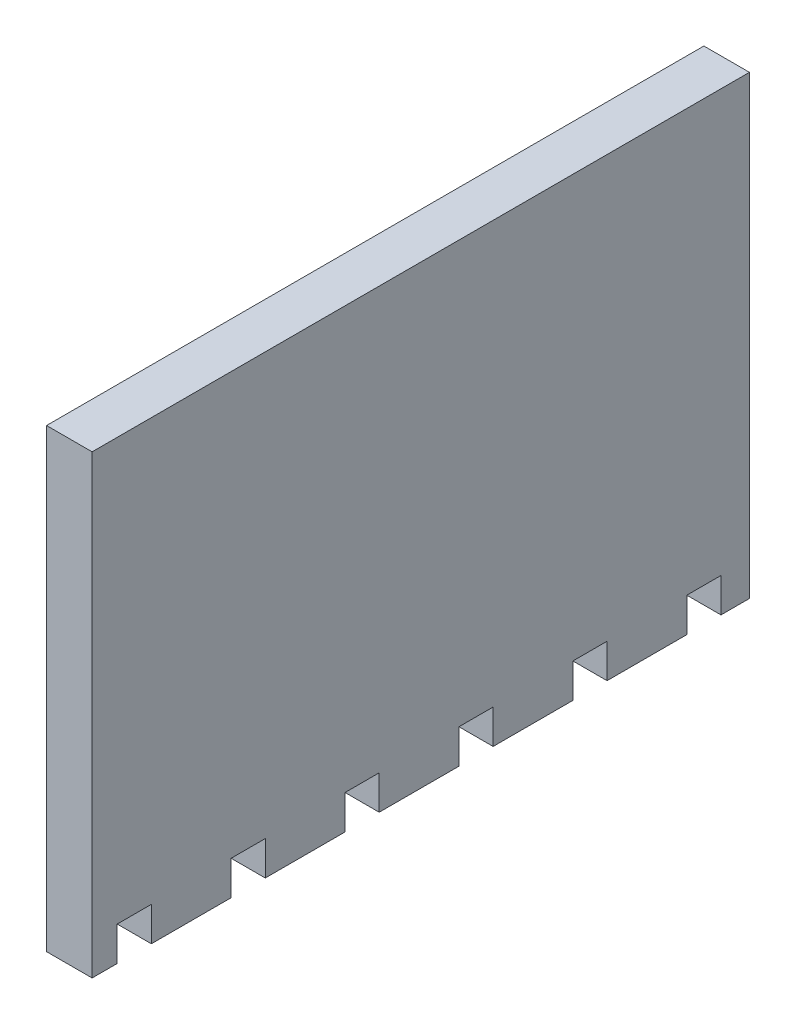
ISO-10303-21;
HEADER;
FILE_DESCRIPTION(('STEP AP214'),'2;1');
FILE_NAME('part.step','',(''),(''),'','','');
FILE_SCHEMA(('AUTOMOTIVE_DESIGN { 1 0 10303 214 1 1 1 1 }'));
ENDSEC;
DATA;
#1=APPLICATION_CONTEXT('core data for automotive mechanical design processes');
#2=APPLICATION_PROTOCOL_DEFINITION('international standard','automotive_design',2000,#1);
#3=PRODUCT_CONTEXT('',#1,'mechanical');
#4=PRODUCT('Part','Part','',(#3));
#5=PRODUCT_RELATED_PRODUCT_CATEGORY('part','',(#4));
#6=PRODUCT_DEFINITION_FORMATION('','',#4);
#7=PRODUCT_DEFINITION_CONTEXT('part definition',#1,'design');
#8=PRODUCT_DEFINITION('design','',#6,#7);
#9=PRODUCT_DEFINITION_SHAPE('','',#8);
#10=(LENGTH_UNIT() NAMED_UNIT(*) SI_UNIT(.MILLI.,.METRE.));
#11=(NAMED_UNIT(*) PLANE_ANGLE_UNIT() SI_UNIT($,.RADIAN.));
#12=(NAMED_UNIT(*) SI_UNIT($,.STERADIAN.) SOLID_ANGLE_UNIT());
#13=UNCERTAINTY_MEASURE_WITH_UNIT(LENGTH_MEASURE(1.E-05),#10,'distance_accuracy_value','');
#14=(GEOMETRIC_REPRESENTATION_CONTEXT(3) GLOBAL_UNCERTAINTY_ASSIGNED_CONTEXT((#13)) GLOBAL_UNIT_ASSIGNED_CONTEXT((#10,
#11,#12)) REPRESENTATION_CONTEXT('',''));
#15=CARTESIAN_POINT('',(0.,0.,0.));
#16=DIRECTION('',(0.,0.,1.));
#17=DIRECTION('',(1.,0.,0.));
#18=AXIS2_PLACEMENT_3D('',#15,#16,#17);
#19=CARTESIAN_POINT('',(-10.,-200.,288.5));
#20=DIRECTION('',(0.,1.,0.));
#21=DIRECTION('',(0.,0.,1.));
#22=AXIS2_PLACEMENT_3D('',#19,#20,#21);
#23=PLANE('',#22);
#24=DIRECTION('',(0.,0.,-1.));
#25=VECTOR('',#24,1.);
#26=CARTESIAN_POINT('',(-10.,-200.,288.5));
#27=LINE('',#26,#25);
#28=CARTESIAN_POINT('',(-10.,-200.,288.5));
#29=VERTEX_POINT('',#28);
#30=CARTESIAN_POINT('',(-10.,-200.,277.5));
#31=VERTEX_POINT('',#30);
#32=EDGE_CURVE('E11',#29,#31,#27,.T.);
#33=ORIENTED_EDGE('',*,*,#32,.T.);
#34=DIRECTION('',(1.,0.,0.));
#35=VECTOR('',#34,1.);
#36=CARTESIAN_POINT('',(-10.,-200.,277.5));
#37=LINE('',#36,#35);
#38=CARTESIAN_POINT('',(10.,-200.,277.5));
#39=VERTEX_POINT('',#38);
#40=EDGE_CURVE('E223',#31,#39,#37,.T.);
#41=ORIENTED_EDGE('',*,*,#40,.T.);
#42=DIRECTION('',(0.,0.,-1.));
#43=VECTOR('',#42,1.);
#44=CARTESIAN_POINT('',(10.,-200.,288.5));
#45=LINE('',#44,#43);
#46=CARTESIAN_POINT('',(10.,-200.,288.5));
#47=VERTEX_POINT('',#46);
#48=EDGE_CURVE('E246',#47,#39,#45,.T.);
#49=ORIENTED_EDGE('',*,*,#48,.F.);
#50=DIRECTION('',(1.,0.,0.));
#51=VECTOR('',#50,1.);
#52=CARTESIAN_POINT('',(-10.,-200.,288.5));
#53=LINE('',#52,#51);
#54=EDGE_CURVE('E244',#29,#47,#53,.T.);
#55=ORIENTED_EDGE('',*,*,#54,.F.);
#56=EDGE_LOOP('',(#33,#41,#49,#55));
#57=FACE_BOUND('',#56,.T.);
#58=ADVANCED_FACE('F35',(#57),#23,.F.);
#59=CARTESIAN_POINT('',(10.,-200.,262.5));
#60=VERTEX_POINT('',#59);
#61=CARTESIAN_POINT('',(10.,-200.,227.5));
#62=VERTEX_POINT('',#61);
#63=EDGE_CURVE('E280',#60,#62,#45,.T.);
#64=ORIENTED_EDGE('',*,*,#63,.F.);
#65=DIRECTION('',(1.,0.,0.));
#66=VECTOR('',#65,1.);
#67=CARTESIAN_POINT('',(-10.,-200.,262.5));
#68=LINE('',#67,#66);
#69=CARTESIAN_POINT('',(-10.,-200.,262.5));
#70=VERTEX_POINT('',#69);
#71=EDGE_CURVE('E233',#70,#60,#68,.T.);
#72=ORIENTED_EDGE('',*,*,#71,.F.);
#73=CARTESIAN_POINT('',(-10.,-200.,227.5));
#74=VERTEX_POINT('',#73);
#75=EDGE_CURVE('E43',#70,#74,#27,.T.);
#76=ORIENTED_EDGE('',*,*,#75,.T.);
#77=DIRECTION('',(1.,0.,0.));
#78=VECTOR('',#77,1.);
#79=CARTESIAN_POINT('',(-10.,-200.,227.5));
#80=LINE('',#79,#78);
#81=EDGE_CURVE('E687',#74,#62,#80,.T.);
#82=ORIENTED_EDGE('',*,*,#81,.T.);
#83=EDGE_LOOP('',(#64,#72,#76,#82));
#84=FACE_BOUND('',#83,.T.);
#85=ADVANCED_FACE('F436',(#84),#23,.F.);
#86=CARTESIAN_POINT('',(10.,-200.,212.5));
#87=VERTEX_POINT('',#86);
#88=CARTESIAN_POINT('',(10.,-200.,177.5));
#89=VERTEX_POINT('',#88);
#90=EDGE_CURVE('E284',#87,#89,#45,.T.);
#91=ORIENTED_EDGE('',*,*,#90,.F.);
#92=DIRECTION('',(1.,0.,0.));
#93=VECTOR('',#92,1.);
#94=CARTESIAN_POINT('',(-10.,-200.,212.5));
#95=LINE('',#94,#93);
#96=CARTESIAN_POINT('',(-10.,-200.,212.5));
#97=VERTEX_POINT('',#96);
#98=EDGE_CURVE('E315',#97,#87,#95,.T.);
#99=ORIENTED_EDGE('',*,*,#98,.F.);
#100=CARTESIAN_POINT('',(-10.,-200.,177.5));
#101=VERTEX_POINT('',#100);
#102=EDGE_CURVE('E318',#97,#101,#27,.T.);
#103=ORIENTED_EDGE('',*,*,#102,.T.);
#104=DIRECTION('',(1.,0.,0.));
#105=VECTOR('',#104,1.);
#106=CARTESIAN_POINT('',(-10.,-200.,177.5));
#107=LINE('',#106,#105);
#108=EDGE_CURVE('E317',#101,#89,#107,.T.);
#109=ORIENTED_EDGE('',*,*,#108,.T.);
#110=EDGE_LOOP('',(#91,#99,#103,#109));
#111=FACE_BOUND('',#110,.T.);
#112=ADVANCED_FACE('F313',(#111),#23,.F.);
#113=CARTESIAN_POINT('',(10.,-200.,162.5));
#114=VERTEX_POINT('',#113);
#115=CARTESIAN_POINT('',(10.,-200.,127.5));
#116=VERTEX_POINT('',#115);
#117=EDGE_CURVE('E292',#114,#116,#45,.T.);
#118=ORIENTED_EDGE('',*,*,#117,.F.);
#119=DIRECTION('',(1.,0.,0.));
#120=VECTOR('',#119,1.);
#121=CARTESIAN_POINT('',(-10.,-200.,162.5));
#122=LINE('',#121,#120);
#123=CARTESIAN_POINT('',(-10.,-200.,162.5));
#124=VERTEX_POINT('',#123);
#125=EDGE_CURVE('E322',#124,#114,#122,.T.);
#126=ORIENTED_EDGE('',*,*,#125,.F.);
#127=CARTESIAN_POINT('',(-10.,-200.,127.5));
#128=VERTEX_POINT('',#127);
#129=EDGE_CURVE('E716',#124,#128,#27,.T.);
#130=ORIENTED_EDGE('',*,*,#129,.T.);
#131=DIRECTION('',(1.,0.,0.));
#132=VECTOR('',#131,1.);
#133=CARTESIAN_POINT('',(-10.,-200.,127.5));
#134=LINE('',#133,#132);
#135=EDGE_CURVE('E342',#128,#116,#134,.T.);
#136=ORIENTED_EDGE('',*,*,#135,.T.);
#137=EDGE_LOOP('',(#118,#126,#130,#136));
#138=FACE_BOUND('',#137,.T.);
#139=ADVANCED_FACE('F451',(#138),#23,.F.);
#140=CARTESIAN_POINT('',(10.,-200.,112.5));
#141=VERTEX_POINT('',#140);
#142=CARTESIAN_POINT('',(10.,-200.,77.5));
#143=VERTEX_POINT('',#142);
#144=EDGE_CURVE('E288',#141,#143,#45,.T.);
#145=ORIENTED_EDGE('',*,*,#144,.F.);
#146=DIRECTION('',(1.,0.,0.));
#147=VECTOR('',#146,1.);
#148=CARTESIAN_POINT('',(-10.,-200.,112.5));
#149=LINE('',#148,#147);
#150=CARTESIAN_POINT('',(-10.,-200.,112.5));
#151=VERTEX_POINT('',#150);
#152=EDGE_CURVE('E355',#151,#141,#149,.T.);
#153=ORIENTED_EDGE('',*,*,#152,.F.);
#154=CARTESIAN_POINT('',(-10.,-200.,77.5));
#155=VERTEX_POINT('',#154);
#156=EDGE_CURVE('E460',#151,#155,#27,.T.);
#157=ORIENTED_EDGE('',*,*,#156,.T.);
#158=DIRECTION('',(1.,0.,0.));
#159=VECTOR('',#158,1.);
#160=CARTESIAN_POINT('',(-10.,-200.,77.5));
#161=LINE('',#160,#159);
#162=EDGE_CURVE('E369',#155,#143,#161,.T.);
#163=ORIENTED_EDGE('',*,*,#162,.T.);
#164=EDGE_LOOP('',(#145,#153,#157,#163));
#165=FACE_BOUND('',#164,.T.);
#166=ADVANCED_FACE('F447',(#165),#23,.F.);
#167=CARTESIAN_POINT('',(10.,-200.,62.5000000000001));
#168=VERTEX_POINT('',#167);
#169=CARTESIAN_POINT('',(10.,-200.,27.5));
#170=VERTEX_POINT('',#169);
#171=EDGE_CURVE('E285',#168,#170,#45,.T.);
#172=ORIENTED_EDGE('',*,*,#171,.F.);
#173=DIRECTION('',(1.,0.,0.));
#174=VECTOR('',#173,1.);
#175=CARTESIAN_POINT('',(-10.,-200.,62.5));
#176=LINE('',#175,#174);
#177=CARTESIAN_POINT('',(-10.,-200.,62.5));
#178=VERTEX_POINT('',#177);
#179=EDGE_CURVE('E59',#178,#168,#176,.T.);
#180=ORIENTED_EDGE('',*,*,#179,.F.);
#181=CARTESIAN_POINT('',(-10.,-200.,27.5));
#182=VERTEX_POINT('',#181);
#183=EDGE_CURVE('E282',#178,#182,#27,.T.);
#184=ORIENTED_EDGE('',*,*,#183,.T.);
#185=DIRECTION('',(1.,0.,0.));
#186=VECTOR('',#185,1.);
#187=CARTESIAN_POINT('',(-10.,-200.,27.5));
#188=LINE('',#187,#186);
#189=EDGE_CURVE('E262',#182,#170,#188,.T.);
#190=ORIENTED_EDGE('',*,*,#189,.T.);
#191=EDGE_LOOP('',(#172,#180,#184,#190));
#192=FACE_BOUND('',#191,.T.);
#193=ADVANCED_FACE('F404',(#192),#23,.F.);
#194=CARTESIAN_POINT('',(-10.,0.,288.5));
#195=DIRECTION('',(1.,0.,0.));
#196=DIRECTION('',(0.,1.,0.));
#197=AXIS2_PLACEMENT_3D('',#194,#195,#196);
#198=PLANE('',#197);
#199=DIRECTION('',(0.,0.,1.));
#200=VECTOR('',#199,1.);
#201=CARTESIAN_POINT('',(-10.,-185.,277.5));
#202=LINE('',#201,#200);
#203=CARTESIAN_POINT('',(-10.,-185.,262.5));
#204=VERTEX_POINT('',#203);
#205=CARTESIAN_POINT('',(-10.,-185.,277.5));
#206=VERTEX_POINT('',#205);
#207=EDGE_CURVE('E234',#204,#206,#202,.T.);
#208=ORIENTED_EDGE('',*,*,#207,.T.);
#209=DIRECTION('',(0.,-1.,0.));
#210=VECTOR('',#209,1.);
#211=CARTESIAN_POINT('',(-10.,-185.,277.5));
#212=LINE('',#211,#210);
#213=EDGE_CURVE('E226',#206,#31,#212,.T.);
#214=ORIENTED_EDGE('',*,*,#213,.T.);
#215=ORIENTED_EDGE('',*,*,#32,.F.);
#216=DIRECTION('',(0.,-1.,0.));
#217=VECTOR('',#216,1.);
#218=CARTESIAN_POINT('',(-10.,0.,288.5));
#219=LINE('',#218,#217);
#220=CARTESIAN_POINT('',(-10.,0.,288.5));
#221=VERTEX_POINT('',#220);
#222=EDGE_CURVE('E250',#221,#29,#219,.T.);
#223=ORIENTED_EDGE('',*,*,#222,.F.);
#224=DIRECTION('',(0.,0.,-1.));
#225=VECTOR('',#224,1.);
#226=CARTESIAN_POINT('',(-10.,0.,288.5));
#227=LINE('',#226,#225);
#228=CARTESIAN_POINT('',(-10.,0.,0.));
#229=VERTEX_POINT('',#228);
#230=EDGE_CURVE('E267',#221,#229,#227,.T.);
#231=ORIENTED_EDGE('',*,*,#230,.T.);
#232=DIRECTION('',(0.,-1.,0.));
#233=VECTOR('',#232,1.);
#234=CARTESIAN_POINT('',(-10.,0.,0.));
#235=LINE('',#234,#233);
#236=CARTESIAN_POINT('',(-10.,-200.,0.));
#237=VERTEX_POINT('',#236);
#238=EDGE_CURVE('E268',#229,#237,#235,.T.);
#239=ORIENTED_EDGE('',*,*,#238,.T.);
#240=CARTESIAN_POINT('',(-10.,-200.,12.5));
#241=VERTEX_POINT('',#240);
#242=EDGE_CURVE('E44',#241,#237,#27,.T.);
#243=ORIENTED_EDGE('',*,*,#242,.F.);
#244=DIRECTION('',(0.,1.,0.));
#245=VECTOR('',#244,1.);
#246=CARTESIAN_POINT('',(-10.,-185.,12.5));
#247=LINE('',#246,#245);
#248=CARTESIAN_POINT('',(-10.,-185.,12.5));
#249=VERTEX_POINT('',#248);
#250=EDGE_CURVE('E386',#241,#249,#247,.T.);
#251=ORIENTED_EDGE('',*,*,#250,.T.);
#252=DIRECTION('',(0.,0.,1.));
#253=VECTOR('',#252,1.);
#254=CARTESIAN_POINT('',(-10.,-185.,27.5));
#255=LINE('',#254,#253);
#256=CARTESIAN_POINT('',(-10.,-185.,27.5));
#257=VERTEX_POINT('',#256);
#258=EDGE_CURVE('E390',#249,#257,#255,.T.);
#259=ORIENTED_EDGE('',*,*,#258,.T.);
#260=DIRECTION('',(0.,-1.,0.));
#261=VECTOR('',#260,1.);
#262=CARTESIAN_POINT('',(-10.,-185.,27.5));
#263=LINE('',#262,#261);
#264=EDGE_CURVE('E383',#257,#182,#263,.T.);
#265=ORIENTED_EDGE('',*,*,#264,.T.);
#266=ORIENTED_EDGE('',*,*,#183,.F.);
#267=DIRECTION('',(0.,1.,0.));
#268=VECTOR('',#267,1.);
#269=CARTESIAN_POINT('',(-10.,-185.,62.5));
#270=LINE('',#269,#268);
#271=CARTESIAN_POINT('',(-10.,-185.,62.5));
#272=VERTEX_POINT('',#271);
#273=EDGE_CURVE('E362',#178,#272,#270,.T.);
#274=ORIENTED_EDGE('',*,*,#273,.T.);
#275=DIRECTION('',(0.,0.,1.));
#276=VECTOR('',#275,1.);
#277=CARTESIAN_POINT('',(-10.,-185.,77.5));
#278=LINE('',#277,#276);
#279=CARTESIAN_POINT('',(-10.,-185.,77.5));
#280=VERTEX_POINT('',#279);
#281=EDGE_CURVE('E366',#272,#280,#278,.T.);
#282=ORIENTED_EDGE('',*,*,#281,.T.);
#283=DIRECTION('',(0.,-1.,0.));
#284=VECTOR('',#283,1.);
#285=CARTESIAN_POINT('',(-10.,-185.,77.5));
#286=LINE('',#285,#284);
#287=EDGE_CURVE('E359',#280,#155,#286,.T.);
#288=ORIENTED_EDGE('',*,*,#287,.T.);
#289=ORIENTED_EDGE('',*,*,#156,.F.);
#290=DIRECTION('',(0.,1.,0.));
#291=VECTOR('',#290,1.);
#292=CARTESIAN_POINT('',(-10.,-185.,112.5));
#293=LINE('',#292,#291);
#294=CARTESIAN_POINT('',(-10.,-185.,112.5));
#295=VERTEX_POINT('',#294);
#296=EDGE_CURVE('E335',#151,#295,#293,.T.);
#297=ORIENTED_EDGE('',*,*,#296,.T.);
#298=DIRECTION('',(0.,0.,1.));
#299=VECTOR('',#298,1.);
#300=CARTESIAN_POINT('',(-10.,-185.,127.5));
#301=LINE('',#300,#299);
#302=CARTESIAN_POINT('',(-10.,-185.,127.5));
#303=VERTEX_POINT('',#302);
#304=EDGE_CURVE('E339',#295,#303,#301,.T.);
#305=ORIENTED_EDGE('',*,*,#304,.T.);
#306=DIRECTION('',(0.,-1.,0.));
#307=VECTOR('',#306,1.);
#308=CARTESIAN_POINT('',(-10.,-185.,127.5));
#309=LINE('',#308,#307);
#310=EDGE_CURVE('E332',#303,#128,#309,.T.);
#311=ORIENTED_EDGE('',*,*,#310,.T.);
#312=ORIENTED_EDGE('',*,*,#129,.F.);
#313=DIRECTION('',(0.,1.,0.));
#314=VECTOR('',#313,1.);
#315=CARTESIAN_POINT('',(-10.,-185.,162.5));
#316=LINE('',#315,#314);
#317=CARTESIAN_POINT('',(-10.,-185.,162.5));
#318=VERTEX_POINT('',#317);
#319=EDGE_CURVE('E328',#124,#318,#316,.T.);
#320=ORIENTED_EDGE('',*,*,#319,.T.);
#321=DIRECTION('',(0.,0.,1.));
#322=VECTOR('',#321,1.);
#323=CARTESIAN_POINT('',(-10.,-185.,177.5));
#324=LINE('',#323,#322);
#325=CARTESIAN_POINT('',(-10.,-185.,177.5));
#326=VERTEX_POINT('',#325);
#327=EDGE_CURVE('E323',#318,#326,#324,.T.);
#328=ORIENTED_EDGE('',*,*,#327,.T.);
#329=DIRECTION('',(0.,-1.,0.));
#330=VECTOR('',#329,1.);
#331=CARTESIAN_POINT('',(-10.,-185.,177.5));
#332=LINE('',#331,#330);
#333=EDGE_CURVE('E701',#326,#101,#332,.T.);
#334=ORIENTED_EDGE('',*,*,#333,.T.);
#335=ORIENTED_EDGE('',*,*,#102,.F.);
#336=DIRECTION('',(0.,1.,0.));
#337=VECTOR('',#336,1.);
#338=CARTESIAN_POINT('',(-10.,-185.,212.5));
#339=LINE('',#338,#337);
#340=CARTESIAN_POINT('',(-10.,-185.,212.5));
#341=VERTEX_POINT('',#340);
#342=EDGE_CURVE('E680',#97,#341,#339,.T.);
#343=ORIENTED_EDGE('',*,*,#342,.T.);
#344=DIRECTION('',(0.,0.,1.));
#345=VECTOR('',#344,1.);
#346=CARTESIAN_POINT('',(-10.,-185.,227.5));
#347=LINE('',#346,#345);
#348=CARTESIAN_POINT('',(-10.,-185.,227.5));
#349=VERTEX_POINT('',#348);
#350=EDGE_CURVE('E684',#341,#349,#347,.T.);
#351=ORIENTED_EDGE('',*,*,#350,.T.);
#352=DIRECTION('',(0.,-1.,0.));
#353=VECTOR('',#352,1.);
#354=CARTESIAN_POINT('',(-10.,-185.,227.5));
#355=LINE('',#354,#353);
#356=EDGE_CURVE('E677',#349,#74,#355,.T.);
#357=ORIENTED_EDGE('',*,*,#356,.T.);
#358=ORIENTED_EDGE('',*,*,#75,.F.);
#359=DIRECTION('',(0.,1.,0.));
#360=VECTOR('',#359,1.);
#361=CARTESIAN_POINT('',(-10.,-185.,262.5));
#362=LINE('',#361,#360);
#363=EDGE_CURVE('E241',#70,#204,#362,.T.);
#364=ORIENTED_EDGE('',*,*,#363,.T.);
#365=EDGE_LOOP('',(#208,#214,#215,#223,#231,#239,#243,#251,#259,#265,#266,#274,#282,#288,#289,
#297,#305,#311,#312,#320,#328,#334,#335,#343,#351,#357,#358,#364));
#366=FACE_BOUND('',#365,.T.);
#367=ADVANCED_FACE('F37',(#366),#198,.F.);
#368=CARTESIAN_POINT('',(10.,-200.,12.5000000000001));
#369=VERTEX_POINT('',#368);
#370=CARTESIAN_POINT('',(10.,-200.,0.));
#371=VERTEX_POINT('',#370);
#372=EDGE_CURVE('E279',#369,#371,#45,.T.);
#373=ORIENTED_EDGE('',*,*,#372,.F.);
#374=DIRECTION('',(1.,0.,0.));
#375=VECTOR('',#374,1.);
#376=CARTESIAN_POINT('',(-10.,-200.,12.5));
#377=LINE('',#376,#375);
#378=EDGE_CURVE('E51',#241,#369,#377,.T.);
#379=ORIENTED_EDGE('',*,*,#378,.F.);
#380=ORIENTED_EDGE('',*,*,#242,.T.);
#381=DIRECTION('',(1.,0.,0.));
#382=VECTOR('',#381,1.);
#383=CARTESIAN_POINT('',(-10.,-200.,0.));
#384=LINE('',#383,#382);
#385=EDGE_CURVE('E271',#237,#371,#384,.T.);
#386=ORIENTED_EDGE('',*,*,#385,.T.);
#387=EDGE_LOOP('',(#373,#379,#380,#386));
#388=FACE_BOUND('',#387,.T.);
#389=ADVANCED_FACE('F415',(#388),#23,.F.);
#390=CARTESIAN_POINT('',(10.,0.,288.5));
#391=DIRECTION('',(-1.,0.,0.));
#392=DIRECTION('',(0.,-1.,0.));
#393=AXIS2_PLACEMENT_3D('',#390,#391,#392);
#394=PLANE('',#393);
#395=ORIENTED_EDGE('',*,*,#48,.T.);
#396=DIRECTION('',(0.,-1.,0.));
#397=VECTOR('',#396,1.);
#398=CARTESIAN_POINT('',(10.,-185.,277.5));
#399=LINE('',#398,#397);
#400=CARTESIAN_POINT('',(10.,-185.,277.5));
#401=VERTEX_POINT('',#400);
#402=EDGE_CURVE('E229',#401,#39,#399,.T.);
#403=ORIENTED_EDGE('',*,*,#402,.F.);
#404=DIRECTION('',(0.,0.,1.));
#405=VECTOR('',#404,1.);
#406=CARTESIAN_POINT('',(10.,-185.,277.5));
#407=LINE('',#406,#405);
#408=CARTESIAN_POINT('',(10.,-185.,262.5));
#409=VERTEX_POINT('',#408);
#410=EDGE_CURVE('E242',#409,#401,#407,.T.);
#411=ORIENTED_EDGE('',*,*,#410,.F.);
#412=DIRECTION('',(0.,1.,0.));
#413=VECTOR('',#412,1.);
#414=CARTESIAN_POINT('',(10.,-185.,262.5));
#415=LINE('',#414,#413);
#416=EDGE_CURVE('E664',#60,#409,#415,.T.);
#417=ORIENTED_EDGE('',*,*,#416,.F.);
#418=ORIENTED_EDGE('',*,*,#63,.T.);
#419=DIRECTION('',(0.,-1.,0.));
#420=VECTOR('',#419,1.);
#421=CARTESIAN_POINT('',(10.,-185.,227.5));
#422=LINE('',#421,#420);
#423=CARTESIAN_POINT('',(10.,-185.,227.5));
#424=VERTEX_POINT('',#423);
#425=EDGE_CURVE('E688',#424,#62,#422,.T.);
#426=ORIENTED_EDGE('',*,*,#425,.F.);
#427=DIRECTION('',(0.,0.,1.));
#428=VECTOR('',#427,1.);
#429=CARTESIAN_POINT('',(10.,-185.,227.5));
#430=LINE('',#429,#428);
#431=CARTESIAN_POINT('',(10.,-185.,212.5));
#432=VERTEX_POINT('',#431);
#433=EDGE_CURVE('E681',#432,#424,#430,.T.);
#434=ORIENTED_EDGE('',*,*,#433,.F.);
#435=DIRECTION('',(0.,1.,0.));
#436=VECTOR('',#435,1.);
#437=CARTESIAN_POINT('',(10.,-185.,212.5));
#438=LINE('',#437,#436);
#439=EDGE_CURVE('E309',#87,#432,#438,.T.);
#440=ORIENTED_EDGE('',*,*,#439,.F.);
#441=ORIENTED_EDGE('',*,*,#90,.T.);
#442=DIRECTION('',(0.,-1.,0.));
#443=VECTOR('',#442,1.);
#444=CARTESIAN_POINT('',(10.,-185.,177.5));
#445=LINE('',#444,#443);
#446=CARTESIAN_POINT('',(10.,-185.,177.5));
#447=VERTEX_POINT('',#446);
#448=EDGE_CURVE('E306',#447,#89,#445,.T.);
#449=ORIENTED_EDGE('',*,*,#448,.F.);
#450=DIRECTION('',(0.,0.,1.));
#451=VECTOR('',#450,1.);
#452=CARTESIAN_POINT('',(10.,-185.,177.5));
#453=LINE('',#452,#451);
#454=CARTESIAN_POINT('',(10.,-185.,162.5));
#455=VERTEX_POINT('',#454);
#456=EDGE_CURVE('E703',#455,#447,#453,.T.);
#457=ORIENTED_EDGE('',*,*,#456,.F.);
#458=DIRECTION('',(0.,1.,0.));
#459=VECTOR('',#458,1.);
#460=CARTESIAN_POINT('',(10.,-185.,162.5));
#461=LINE('',#460,#459);
#462=EDGE_CURVE('E707',#114,#455,#461,.T.);
#463=ORIENTED_EDGE('',*,*,#462,.F.);
#464=ORIENTED_EDGE('',*,*,#117,.T.);
#465=DIRECTION('',(0.,-1.,0.));
#466=VECTOR('',#465,1.);
#467=CARTESIAN_POINT('',(10.,-185.,127.5));
#468=LINE('',#467,#466);
#469=CARTESIAN_POINT('',(10.,-185.,127.5));
#470=VERTEX_POINT('',#469);
#471=EDGE_CURVE('E343',#470,#116,#468,.T.);
#472=ORIENTED_EDGE('',*,*,#471,.F.);
#473=DIRECTION('',(0.,0.,1.));
#474=VECTOR('',#473,1.);
#475=CARTESIAN_POINT('',(10.,-185.,127.5));
#476=LINE('',#475,#474);
#477=CARTESIAN_POINT('',(10.,-185.,112.5));
#478=VERTEX_POINT('',#477);
#479=EDGE_CURVE('E336',#478,#470,#476,.T.);
#480=ORIENTED_EDGE('',*,*,#479,.F.);
#481=DIRECTION('',(0.,1.,0.));
#482=VECTOR('',#481,1.);
#483=CARTESIAN_POINT('',(10.,-185.,112.5));
#484=LINE('',#483,#482);
#485=EDGE_CURVE('E345',#141,#478,#484,.T.);
#486=ORIENTED_EDGE('',*,*,#485,.F.);
#487=ORIENTED_EDGE('',*,*,#144,.T.);
#488=DIRECTION('',(0.,-1.,0.));
#489=VECTOR('',#488,1.);
#490=CARTESIAN_POINT('',(10.,-185.,77.5));
#491=LINE('',#490,#489);
#492=CARTESIAN_POINT('',(10.,-185.,77.5));
#493=VERTEX_POINT('',#492);
#494=EDGE_CURVE('E370',#493,#143,#491,.T.);
#495=ORIENTED_EDGE('',*,*,#494,.F.);
#496=DIRECTION('',(0.,0.,1.));
#497=VECTOR('',#496,1.);
#498=CARTESIAN_POINT('',(10.,-185.,77.5));
#499=LINE('',#498,#497);
#500=CARTESIAN_POINT('',(10.,-185.,62.5));
#501=VERTEX_POINT('',#500);
#502=EDGE_CURVE('E363',#501,#493,#499,.T.);
#503=ORIENTED_EDGE('',*,*,#502,.F.);
#504=DIRECTION('',(0.,1.,0.));
#505=VECTOR('',#504,1.);
#506=CARTESIAN_POINT('',(10.,-185.,62.5));
#507=LINE('',#506,#505);
#508=EDGE_CURVE('E372',#168,#501,#507,.T.);
#509=ORIENTED_EDGE('',*,*,#508,.F.);
#510=ORIENTED_EDGE('',*,*,#171,.T.);
#511=DIRECTION('',(0.,-1.,0.));
#512=VECTOR('',#511,1.);
#513=CARTESIAN_POINT('',(10.,-185.,27.5));
#514=LINE('',#513,#512);
#515=CARTESIAN_POINT('',(10.,-185.,27.5));
#516=VERTEX_POINT('',#515);
#517=EDGE_CURVE('E393',#516,#170,#514,.T.);
#518=ORIENTED_EDGE('',*,*,#517,.F.);
#519=DIRECTION('',(0.,0.,1.));
#520=VECTOR('',#519,1.);
#521=CARTESIAN_POINT('',(10.,-185.,27.5));
#522=LINE('',#521,#520);
#523=CARTESIAN_POINT('',(10.,-185.,12.5));
#524=VERTEX_POINT('',#523);
#525=EDGE_CURVE('E387',#524,#516,#522,.T.);
#526=ORIENTED_EDGE('',*,*,#525,.F.);
#527=DIRECTION('',(0.,1.,0.));
#528=VECTOR('',#527,1.);
#529=CARTESIAN_POINT('',(10.,-185.,12.5));
#530=LINE('',#529,#528);
#531=EDGE_CURVE('E395',#369,#524,#530,.T.);
#532=ORIENTED_EDGE('',*,*,#531,.F.);
#533=ORIENTED_EDGE('',*,*,#372,.T.);
#534=DIRECTION('',(0.,1.,0.));
#535=VECTOR('',#534,1.);
#536=CARTESIAN_POINT('',(10.,0.,0.));
#537=LINE('',#536,#535);
#538=CARTESIAN_POINT('',(10.,0.,0.));
#539=VERTEX_POINT('',#538);
#540=EDGE_CURVE('E259',#371,#539,#537,.T.);
#541=ORIENTED_EDGE('',*,*,#540,.T.);
#542=DIRECTION('',(0.,0.,-1.));
#543=VECTOR('',#542,1.);
#544=CARTESIAN_POINT('',(10.,0.,288.5));
#545=LINE('',#544,#543);
#546=CARTESIAN_POINT('',(10.,0.,288.5));
#547=VERTEX_POINT('',#546);
#548=EDGE_CURVE('E277',#547,#539,#545,.T.);
#549=ORIENTED_EDGE('',*,*,#548,.F.);
#550=DIRECTION('',(0.,1.,0.));
#551=VECTOR('',#550,1.);
#552=CARTESIAN_POINT('',(10.,0.,288.5));
#553=LINE('',#552,#551);
#554=EDGE_CURVE('E249',#47,#547,#553,.T.);
#555=ORIENTED_EDGE('',*,*,#554,.F.);
#556=EDGE_LOOP('',(#395,#403,#411,#417,#418,#426,#434,#440,#441,#449,#457,#463,#464,#472,#480,
#486,#487,#495,#503,#509,#510,#518,#526,#532,#533,#541,#549,#555));
#557=FACE_BOUND('',#556,.T.);
#558=ADVANCED_FACE('F304',(#557),#394,.F.);
#559=CARTESIAN_POINT('',(-10.,0.,288.5));
#560=DIRECTION('',(0.,-1.,0.));
#561=DIRECTION('',(0.,0.,-1.));
#562=AXIS2_PLACEMENT_3D('',#559,#560,#561);
#563=PLANE('',#562);
#564=DIRECTION('',(-1.,0.,0.));
#565=VECTOR('',#564,1.);
#566=CARTESIAN_POINT('',(-10.,0.,0.));
#567=LINE('',#566,#565);
#568=EDGE_CURVE('E257',#539,#229,#567,.T.);
#569=ORIENTED_EDGE('',*,*,#568,.T.);
#570=ORIENTED_EDGE('',*,*,#230,.F.);
#571=DIRECTION('',(-1.,0.,0.));
#572=VECTOR('',#571,1.);
#573=CARTESIAN_POINT('',(-10.,0.,288.5));
#574=LINE('',#573,#572);
#575=EDGE_CURVE('E254',#547,#221,#574,.T.);
#576=ORIENTED_EDGE('',*,*,#575,.F.);
#577=ORIENTED_EDGE('',*,*,#548,.T.);
#578=EDGE_LOOP('',(#569,#570,#576,#577));
#579=FACE_BOUND('',#578,.T.);
#580=ADVANCED_FACE('F424',(#579),#563,.F.);
#581=CARTESIAN_POINT('',(0.,0.,288.5));
#582=DIRECTION('',(0.,0.,1.));
#583=DIRECTION('',(1.,0.,0.));
#584=AXIS2_PLACEMENT_3D('',#581,#582,#583);
#585=PLANE('',#584);
#586=ORIENTED_EDGE('',*,*,#222,.T.);
#587=ORIENTED_EDGE('',*,*,#54,.T.);
#588=ORIENTED_EDGE('',*,*,#554,.T.);
#589=ORIENTED_EDGE('',*,*,#575,.T.);
#590=EDGE_LOOP('',(#586,#587,#588,#589));
#591=FACE_BOUND('',#590,.T.);
#592=ADVANCED_FACE('F252',(#591),#585,.T.);
#593=CARTESIAN_POINT('',(0.,0.,0.));
#594=DIRECTION('',(0.,0.,1.));
#595=DIRECTION('',(1.,0.,0.));
#596=AXIS2_PLACEMENT_3D('',#593,#594,#595);
#597=PLANE('',#596);
#598=ORIENTED_EDGE('',*,*,#238,.F.);
#599=ORIENTED_EDGE('',*,*,#568,.F.);
#600=ORIENTED_EDGE('',*,*,#540,.F.);
#601=ORIENTED_EDGE('',*,*,#385,.F.);
#602=EDGE_LOOP('',(#598,#599,#600,#601));
#603=FACE_BOUND('',#602,.T.);
#604=ADVANCED_FACE('F421',(#603),#597,.F.);
#605=CARTESIAN_POINT('',(-10.,-185.,27.5));
#606=DIRECTION('',(0.,0.,1.));
#607=DIRECTION('',(1.,0.,0.));
#608=AXIS2_PLACEMENT_3D('',#605,#606,#607);
#609=PLANE('',#608);
#610=ORIENTED_EDGE('',*,*,#517,.T.);
#611=ORIENTED_EDGE('',*,*,#189,.F.);
#612=ORIENTED_EDGE('',*,*,#264,.F.);
#613=DIRECTION('',(1.,0.,0.));
#614=VECTOR('',#613,1.);
#615=CARTESIAN_POINT('',(-10.,-185.,27.5));
#616=LINE('',#615,#614);
#617=EDGE_CURVE('E373',#257,#516,#616,.T.);
#618=ORIENTED_EDGE('',*,*,#617,.T.);
#619=EDGE_LOOP('',(#610,#611,#612,#618));
#620=FACE_BOUND('',#619,.T.);
#621=ADVANCED_FACE('F408',(#620),#609,.F.);
#622=CARTESIAN_POINT('',(-10.,-185.,27.5));
#623=DIRECTION('',(0.,1.,0.));
#624=DIRECTION('',(-1.,0.,0.));
#625=AXIS2_PLACEMENT_3D('',#622,#623,#624);
#626=PLANE('',#625);
#627=ORIENTED_EDGE('',*,*,#525,.T.);
#628=ORIENTED_EDGE('',*,*,#617,.F.);
#629=ORIENTED_EDGE('',*,*,#258,.F.);
#630=DIRECTION('',(1.,0.,0.));
#631=VECTOR('',#630,1.);
#632=CARTESIAN_POINT('',(-10.,-185.,12.5));
#633=LINE('',#632,#631);
#634=EDGE_CURVE('E400',#249,#524,#633,.T.);
#635=ORIENTED_EDGE('',*,*,#634,.T.);
#636=EDGE_LOOP('',(#627,#628,#629,#635));
#637=FACE_BOUND('',#636,.T.);
#638=ADVANCED_FACE('F412',(#637),#626,.F.);
#639=CARTESIAN_POINT('',(-10.,-185.,12.5));
#640=DIRECTION('',(0.,0.,-1.));
#641=DIRECTION('',(-1.,0.,0.));
#642=AXIS2_PLACEMENT_3D('',#639,#640,#641);
#643=PLANE('',#642);
#644=ORIENTED_EDGE('',*,*,#531,.T.);
#645=ORIENTED_EDGE('',*,*,#634,.F.);
#646=ORIENTED_EDGE('',*,*,#250,.F.);
#647=ORIENTED_EDGE('',*,*,#378,.T.);
#648=EDGE_LOOP('',(#644,#645,#646,#647));
#649=FACE_BOUND('',#648,.T.);
#650=ADVANCED_FACE('F483',(#649),#643,.F.);
#651=CARTESIAN_POINT('',(-10.,-185.,77.5));
#652=DIRECTION('',(0.,0.,1.));
#653=DIRECTION('',(1.,0.,0.));
#654=AXIS2_PLACEMENT_3D('',#651,#652,#653);
#655=PLANE('',#654);
#656=ORIENTED_EDGE('',*,*,#494,.T.);
#657=ORIENTED_EDGE('',*,*,#162,.F.);
#658=ORIENTED_EDGE('',*,*,#287,.F.);
#659=DIRECTION('',(1.,0.,0.));
#660=VECTOR('',#659,1.);
#661=CARTESIAN_POINT('',(-10.,-185.,77.5));
#662=LINE('',#661,#660);
#663=EDGE_CURVE('E346',#280,#493,#662,.T.);
#664=ORIENTED_EDGE('',*,*,#663,.T.);
#665=EDGE_LOOP('',(#656,#657,#658,#664));
#666=FACE_BOUND('',#665,.T.);
#667=ADVANCED_FACE('F463',(#666),#655,.F.);
#668=CARTESIAN_POINT('',(-10.,-185.,77.5));
#669=DIRECTION('',(0.,1.,0.));
#670=DIRECTION('',(-1.,0.,0.));
#671=AXIS2_PLACEMENT_3D('',#668,#669,#670);
#672=PLANE('',#671);
#673=ORIENTED_EDGE('',*,*,#502,.T.);
#674=ORIENTED_EDGE('',*,*,#663,.F.);
#675=ORIENTED_EDGE('',*,*,#281,.F.);
#676=DIRECTION('',(1.,0.,0.));
#677=VECTOR('',#676,1.);
#678=CARTESIAN_POINT('',(-10.,-185.,62.5));
#679=LINE('',#678,#677);
#680=EDGE_CURVE('E378',#272,#501,#679,.T.);
#681=ORIENTED_EDGE('',*,*,#680,.T.);
#682=EDGE_LOOP('',(#673,#674,#675,#681));
#683=FACE_BOUND('',#682,.T.);
#684=ADVANCED_FACE('F466',(#683),#672,.F.);
#685=CARTESIAN_POINT('',(-10.,-185.,62.5));
#686=DIRECTION('',(0.,0.,-1.));
#687=DIRECTION('',(-1.,0.,0.));
#688=AXIS2_PLACEMENT_3D('',#685,#686,#687);
#689=PLANE('',#688);
#690=ORIENTED_EDGE('',*,*,#508,.T.);
#691=ORIENTED_EDGE('',*,*,#680,.F.);
#692=ORIENTED_EDGE('',*,*,#273,.F.);
#693=ORIENTED_EDGE('',*,*,#179,.T.);
#694=EDGE_LOOP('',(#690,#691,#692,#693));
#695=FACE_BOUND('',#694,.T.);
#696=ADVANCED_FACE('F468',(#695),#689,.F.);
#697=CARTESIAN_POINT('',(-10.,-185.,127.5));
#698=DIRECTION('',(0.,0.,1.));
#699=DIRECTION('',(1.,0.,0.));
#700=AXIS2_PLACEMENT_3D('',#697,#698,#699);
#701=PLANE('',#700);
#702=ORIENTED_EDGE('',*,*,#471,.T.);
#703=ORIENTED_EDGE('',*,*,#135,.F.);
#704=ORIENTED_EDGE('',*,*,#310,.F.);
#705=DIRECTION('',(1.,0.,0.));
#706=VECTOR('',#705,1.);
#707=CARTESIAN_POINT('',(-10.,-185.,127.5));
#708=LINE('',#707,#706);
#709=EDGE_CURVE('E351',#303,#470,#708,.T.);
#710=ORIENTED_EDGE('',*,*,#709,.T.);
#711=EDGE_LOOP('',(#702,#703,#704,#710));
#712=FACE_BOUND('',#711,.T.);
#713=ADVANCED_FACE('F470',(#712),#701,.F.);
#714=CARTESIAN_POINT('',(-10.,-185.,127.5));
#715=DIRECTION('',(0.,1.,0.));
#716=DIRECTION('',(-1.,0.,0.));
#717=AXIS2_PLACEMENT_3D('',#714,#715,#716);
#718=PLANE('',#717);
#719=ORIENTED_EDGE('',*,*,#479,.T.);
#720=ORIENTED_EDGE('',*,*,#709,.F.);
#721=ORIENTED_EDGE('',*,*,#304,.F.);
#722=DIRECTION('',(1.,0.,0.));
#723=VECTOR('',#722,1.);
#724=CARTESIAN_POINT('',(-10.,-185.,112.5));
#725=LINE('',#724,#723);
#726=EDGE_CURVE('E353',#295,#478,#725,.T.);
#727=ORIENTED_EDGE('',*,*,#726,.T.);
#728=EDGE_LOOP('',(#719,#720,#721,#727));
#729=FACE_BOUND('',#728,.T.);
#730=ADVANCED_FACE('F476',(#729),#718,.F.);
#731=CARTESIAN_POINT('',(-10.,-185.,112.5));
#732=DIRECTION('',(0.,0.,-1.));
#733=DIRECTION('',(-1.,0.,0.));
#734=AXIS2_PLACEMENT_3D('',#731,#732,#733);
#735=PLANE('',#734);
#736=ORIENTED_EDGE('',*,*,#485,.T.);
#737=ORIENTED_EDGE('',*,*,#726,.F.);
#738=ORIENTED_EDGE('',*,*,#296,.F.);
#739=ORIENTED_EDGE('',*,*,#152,.T.);
#740=EDGE_LOOP('',(#736,#737,#738,#739));
#741=FACE_BOUND('',#740,.T.);
#742=ADVANCED_FACE('F561',(#741),#735,.F.);
#743=CARTESIAN_POINT('',(-10.,-185.,177.5));
#744=DIRECTION('',(0.,0.,1.));
#745=DIRECTION('',(1.,0.,0.));
#746=AXIS2_PLACEMENT_3D('',#743,#744,#745);
#747=PLANE('',#746);
#748=ORIENTED_EDGE('',*,*,#448,.T.);
#749=ORIENTED_EDGE('',*,*,#108,.F.);
#750=ORIENTED_EDGE('',*,*,#333,.F.);
#751=DIRECTION('',(1.,0.,0.));
#752=VECTOR('',#751,1.);
#753=CARTESIAN_POINT('',(-10.,-185.,177.5));
#754=LINE('',#753,#752);
#755=EDGE_CURVE('E690',#326,#447,#754,.T.);
#756=ORIENTED_EDGE('',*,*,#755,.T.);
#757=EDGE_LOOP('',(#748,#749,#750,#756));
#758=FACE_BOUND('',#757,.T.);
#759=ADVANCED_FACE('F571',(#758),#747,.F.);
#760=CARTESIAN_POINT('',(-10.,-185.,177.5));
#761=DIRECTION('',(0.,1.,0.));
#762=DIRECTION('',(-1.,0.,0.));
#763=AXIS2_PLACEMENT_3D('',#760,#761,#762);
#764=PLANE('',#763);
#765=ORIENTED_EDGE('',*,*,#456,.T.);
#766=ORIENTED_EDGE('',*,*,#755,.F.);
#767=ORIENTED_EDGE('',*,*,#327,.F.);
#768=DIRECTION('',(1.,0.,0.));
#769=VECTOR('',#768,1.);
#770=CARTESIAN_POINT('',(-10.,-185.,162.5));
#771=LINE('',#770,#769);
#772=EDGE_CURVE('E325',#318,#455,#771,.T.);
#773=ORIENTED_EDGE('',*,*,#772,.T.);
#774=EDGE_LOOP('',(#765,#766,#767,#773));
#775=FACE_BOUND('',#774,.T.);
#776=ADVANCED_FACE('F581',(#775),#764,.F.);
#777=CARTESIAN_POINT('',(-10.,-185.,162.5));
#778=DIRECTION('',(0.,0.,-1.));
#779=DIRECTION('',(-1.,0.,0.));
#780=AXIS2_PLACEMENT_3D('',#777,#778,#779);
#781=PLANE('',#780);
#782=ORIENTED_EDGE('',*,*,#462,.T.);
#783=ORIENTED_EDGE('',*,*,#772,.F.);
#784=ORIENTED_EDGE('',*,*,#319,.F.);
#785=ORIENTED_EDGE('',*,*,#125,.T.);
#786=EDGE_LOOP('',(#782,#783,#784,#785));
#787=FACE_BOUND('',#786,.T.);
#788=ADVANCED_FACE('F590',(#787),#781,.F.);
#789=CARTESIAN_POINT('',(-10.,-185.,227.5));
#790=DIRECTION('',(0.,0.,1.));
#791=DIRECTION('',(1.,0.,0.));
#792=AXIS2_PLACEMENT_3D('',#789,#790,#791);
#793=PLANE('',#792);
#794=ORIENTED_EDGE('',*,*,#425,.T.);
#795=ORIENTED_EDGE('',*,*,#81,.F.);
#796=ORIENTED_EDGE('',*,*,#356,.F.);
#797=DIRECTION('',(1.,0.,0.));
#798=VECTOR('',#797,1.);
#799=CARTESIAN_POINT('',(-10.,-185.,227.5));
#800=LINE('',#799,#798);
#801=EDGE_CURVE('E694',#349,#424,#800,.T.);
#802=ORIENTED_EDGE('',*,*,#801,.T.);
#803=EDGE_LOOP('',(#794,#795,#796,#802));
#804=FACE_BOUND('',#803,.T.);
#805=ADVANCED_FACE('F600',(#804),#793,.F.);
#806=CARTESIAN_POINT('',(-10.,-185.,227.5));
#807=DIRECTION('',(0.,1.,0.));
#808=DIRECTION('',(-1.,0.,0.));
#809=AXIS2_PLACEMENT_3D('',#806,#807,#808);
#810=PLANE('',#809);
#811=ORIENTED_EDGE('',*,*,#433,.T.);
#812=ORIENTED_EDGE('',*,*,#801,.F.);
#813=ORIENTED_EDGE('',*,*,#350,.F.);
#814=DIRECTION('',(1.,0.,0.));
#815=VECTOR('',#814,1.);
#816=CARTESIAN_POINT('',(-10.,-185.,212.5));
#817=LINE('',#816,#815);
#818=EDGE_CURVE('E696',#341,#432,#817,.T.);
#819=ORIENTED_EDGE('',*,*,#818,.T.);
#820=EDGE_LOOP('',(#811,#812,#813,#819));
#821=FACE_BOUND('',#820,.T.);
#822=ADVANCED_FACE('F610',(#821),#810,.F.);
#823=CARTESIAN_POINT('',(-10.,-185.,212.5));
#824=DIRECTION('',(0.,0.,-1.));
#825=DIRECTION('',(-1.,0.,0.));
#826=AXIS2_PLACEMENT_3D('',#823,#824,#825);
#827=PLANE('',#826);
#828=ORIENTED_EDGE('',*,*,#439,.T.);
#829=ORIENTED_EDGE('',*,*,#818,.F.);
#830=ORIENTED_EDGE('',*,*,#342,.F.);
#831=ORIENTED_EDGE('',*,*,#98,.T.);
#832=EDGE_LOOP('',(#828,#829,#830,#831));
#833=FACE_BOUND('',#832,.T.);
#834=ADVANCED_FACE('F620',(#833),#827,.F.);
#835=CARTESIAN_POINT('',(-10.,-185.,277.5));
#836=DIRECTION('',(0.,0.,1.));
#837=DIRECTION('',(1.,0.,0.));
#838=AXIS2_PLACEMENT_3D('',#835,#836,#837);
#839=PLANE('',#838);
#840=ORIENTED_EDGE('',*,*,#402,.T.);
#841=ORIENTED_EDGE('',*,*,#40,.F.);
#842=ORIENTED_EDGE('',*,*,#213,.F.);
#843=DIRECTION('',(1.,0.,0.));
#844=VECTOR('',#843,1.);
#845=CARTESIAN_POINT('',(-10.,-185.,277.5));
#846=LINE('',#845,#844);
#847=EDGE_CURVE('E272',#206,#401,#846,.T.);
#848=ORIENTED_EDGE('',*,*,#847,.T.);
#849=EDGE_LOOP('',(#840,#841,#842,#848));
#850=FACE_BOUND('',#849,.T.);
#851=ADVANCED_FACE('F225',(#850),#839,.F.);
#852=CARTESIAN_POINT('',(-10.,-185.,277.5));
#853=DIRECTION('',(0.,1.,0.));
#854=DIRECTION('',(-1.,0.,0.));
#855=AXIS2_PLACEMENT_3D('',#852,#853,#854);
#856=PLANE('',#855);
#857=ORIENTED_EDGE('',*,*,#410,.T.);
#858=ORIENTED_EDGE('',*,*,#847,.F.);
#859=ORIENTED_EDGE('',*,*,#207,.F.);
#860=DIRECTION('',(1.,0.,0.));
#861=VECTOR('',#860,1.);
#862=CARTESIAN_POINT('',(-10.,-185.,262.5));
#863=LINE('',#862,#861);
#864=EDGE_CURVE('E666',#204,#409,#863,.T.);
#865=ORIENTED_EDGE('',*,*,#864,.T.);
#866=EDGE_LOOP('',(#857,#858,#859,#865));
#867=FACE_BOUND('',#866,.T.);
#868=ADVANCED_FACE('F639',(#867),#856,.F.);
#869=CARTESIAN_POINT('',(-10.,-185.,262.5));
#870=DIRECTION('',(0.,0.,-1.));
#871=DIRECTION('',(-1.,0.,0.));
#872=AXIS2_PLACEMENT_3D('',#869,#870,#871);
#873=PLANE('',#872);
#874=ORIENTED_EDGE('',*,*,#416,.T.);
#875=ORIENTED_EDGE('',*,*,#864,.F.);
#876=ORIENTED_EDGE('',*,*,#363,.F.);
#877=ORIENTED_EDGE('',*,*,#71,.T.);
#878=EDGE_LOOP('',(#874,#875,#876,#877));
#879=FACE_BOUND('',#878,.T.);
#880=ADVANCED_FACE('F648',(#879),#873,.F.);
#881=CLOSED_SHELL('',(#58,#85,#112,#139,#166,#193,#367,#389,#558,#580,#592,#604,#621,#638,#650,
#667,#684,#696,#713,#730,#742,#759,#776,#788,#805,#822,#834,#851,#868,#880));
#882=MANIFOLD_SOLID_BREP('B2',#881);
#883=ADVANCED_BREP_SHAPE_REPRESENTATION('',(#18,#882),#14);
#884=SHAPE_DEFINITION_REPRESENTATION(#9,#883);
ENDSEC;
END-ISO-10303-21;
